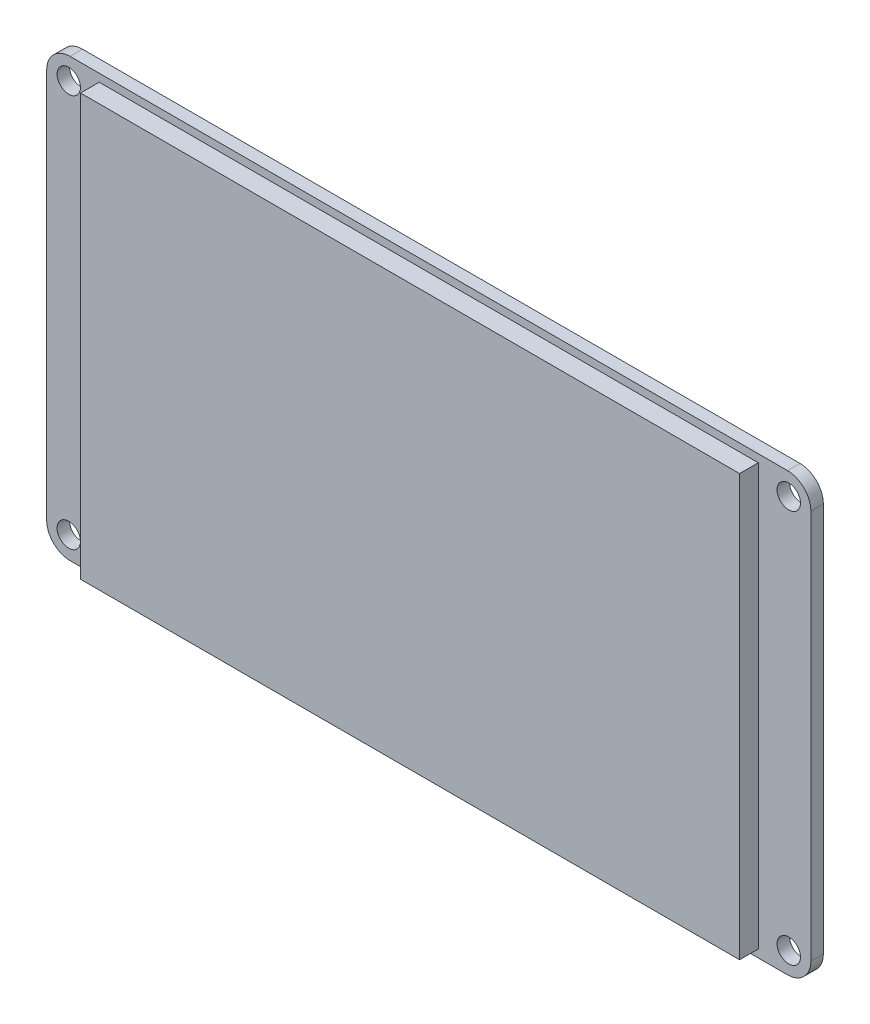
ISO-10303-21;
HEADER;
FILE_DESCRIPTION(('STEP AP214'),'2;1');
FILE_NAME('part.step','',(''),(''),'','','');
FILE_SCHEMA(('AUTOMOTIVE_DESIGN { 1 0 10303 214 1 1 1 1 }'));
ENDSEC;
DATA;
#1=APPLICATION_CONTEXT('core data for automotive mechanical design processes');
#2=APPLICATION_PROTOCOL_DEFINITION('international standard','automotive_design',2000,#1);
#3=PRODUCT_CONTEXT('',#1,'mechanical');
#4=PRODUCT('Part','Part','',(#3));
#5=PRODUCT_RELATED_PRODUCT_CATEGORY('part','',(#4));
#6=PRODUCT_DEFINITION_FORMATION('','',#4);
#7=PRODUCT_DEFINITION_CONTEXT('part definition',#1,'design');
#8=PRODUCT_DEFINITION('design','',#6,#7);
#9=PRODUCT_DEFINITION_SHAPE('','',#8);
#10=(LENGTH_UNIT() NAMED_UNIT(*) SI_UNIT(.MILLI.,.METRE.));
#11=(NAMED_UNIT(*) PLANE_ANGLE_UNIT() SI_UNIT($,.RADIAN.));
#12=(NAMED_UNIT(*) SI_UNIT($,.STERADIAN.) SOLID_ANGLE_UNIT());
#13=UNCERTAINTY_MEASURE_WITH_UNIT(LENGTH_MEASURE(1.E-05),#10,'distance_accuracy_value','');
#14=(GEOMETRIC_REPRESENTATION_CONTEXT(3) GLOBAL_UNCERTAINTY_ASSIGNED_CONTEXT((#13)) GLOBAL_UNIT_ASSIGNED_CONTEXT((#10,
#11,#12)) REPRESENTATION_CONTEXT('',''));
#15=CARTESIAN_POINT('',(0.,0.,0.));
#16=DIRECTION('',(0.,0.,1.));
#17=DIRECTION('',(1.,0.,0.));
#18=AXIS2_PLACEMENT_3D('',#15,#16,#17);
#19=CARTESIAN_POINT('',(0.,28.,1.6));
#20=DIRECTION('',(0.,1.,0.));
#21=DIRECTION('',(-1.,0.,0.));
#22=AXIS2_PLACEMENT_3D('',#19,#20,#21);
#23=PLANE('',#22);
#24=DIRECTION('',(1.,0.,0.));
#25=VECTOR('',#24,1.);
#26=CARTESIAN_POINT('',(0.,28.,0.));
#27=LINE('',#26,#25);
#28=CARTESIAN_POINT('',(-46.,28.,0.));
#29=VERTEX_POINT('',#28);
#30=CARTESIAN_POINT('',(46.,28.,0.));
#31=VERTEX_POINT('',#30);
#32=EDGE_CURVE('E155',#29,#31,#27,.T.);
#33=ORIENTED_EDGE('',*,*,#32,.F.);
#34=DIRECTION('',(0.,0.,-1.));
#35=VECTOR('',#34,1.);
#36=CARTESIAN_POINT('',(-46.,28.,1.6));
#37=LINE('',#36,#35);
#38=CARTESIAN_POINT('',(-46.,28.,1.6));
#39=VERTEX_POINT('',#38);
#40=EDGE_CURVE('E11',#39,#29,#37,.T.);
#41=ORIENTED_EDGE('',*,*,#40,.F.);
#42=DIRECTION('',(1.,0.,0.));
#43=VECTOR('',#42,1.);
#44=CARTESIAN_POINT('',(0.,28.,1.6));
#45=LINE('',#44,#43);
#46=CARTESIAN_POINT('',(46.,28.,1.6));
#47=VERTEX_POINT('',#46);
#48=EDGE_CURVE('E419',#39,#47,#45,.T.);
#49=ORIENTED_EDGE('',*,*,#48,.T.);
#50=DIRECTION('',(0.,0.,-1.));
#51=VECTOR('',#50,1.);
#52=CARTESIAN_POINT('',(46.,28.,1.6));
#53=LINE('',#52,#51);
#54=EDGE_CURVE('E60',#47,#31,#53,.T.);
#55=ORIENTED_EDGE('',*,*,#54,.T.);
#56=EDGE_LOOP('',(#33,#41,#49,#55));
#57=FACE_BOUND('',#56,.T.);
#58=ADVANCED_FACE('F36',(#57),#23,.T.);
#59=CARTESIAN_POINT('',(-46.,25.,1.6));
#60=DIRECTION('',(0.,0.,-1.));
#61=DIRECTION('',(-1.,0.,0.));
#62=AXIS2_PLACEMENT_3D('',#59,#60,#61);
#63=CYLINDRICAL_SURFACE('',#62,3.);
#64=CARTESIAN_POINT('',(-46.,25.,0.));
#65=DIRECTION('',(0.,0.,1.));
#66=DIRECTION('',(1.,0.,0.));
#67=AXIS2_PLACEMENT_3D('',#64,#65,#66);
#68=CIRCLE('',#67,3.);
#69=CARTESIAN_POINT('',(-49.,25.,0.));
#70=VERTEX_POINT('',#69);
#71=EDGE_CURVE('E157',#29,#70,#68,.T.);
#72=ORIENTED_EDGE('',*,*,#71,.T.);
#73=DIRECTION('',(0.,0.,-1.));
#74=VECTOR('',#73,1.);
#75=CARTESIAN_POINT('',(-49.,25.,1.6));
#76=LINE('',#75,#74);
#77=CARTESIAN_POINT('',(-49.,25.,1.6));
#78=VERTEX_POINT('',#77);
#79=EDGE_CURVE('E44',#78,#70,#76,.T.);
#80=ORIENTED_EDGE('',*,*,#79,.F.);
#81=CARTESIAN_POINT('',(-46.,25.,1.6));
#82=DIRECTION('',(0.,0.,1.));
#83=DIRECTION('',(1.,0.,0.));
#84=AXIS2_PLACEMENT_3D('',#81,#82,#83);
#85=CIRCLE('',#84,3.);
#86=EDGE_CURVE('E421',#39,#78,#85,.T.);
#87=ORIENTED_EDGE('',*,*,#86,.F.);
#88=ORIENTED_EDGE('',*,*,#40,.T.);
#89=EDGE_LOOP('',(#72,#80,#87,#88));
#90=FACE_BOUND('',#89,.T.);
#91=ADVANCED_FACE('F194',(#90),#63,.T.);
#92=CARTESIAN_POINT('',(-49.,0.,1.6));
#93=DIRECTION('',(1.,0.,0.));
#94=DIRECTION('',(0.,1.,0.));
#95=AXIS2_PLACEMENT_3D('',#92,#93,#94);
#96=PLANE('',#95);
#97=DIRECTION('',(0.,-1.,0.));
#98=VECTOR('',#97,1.);
#99=CARTESIAN_POINT('',(-49.,0.,0.));
#100=LINE('',#99,#98);
#101=CARTESIAN_POINT('',(-49.,-25.,0.));
#102=VERTEX_POINT('',#101);
#103=EDGE_CURVE('E160',#70,#102,#100,.T.);
#104=ORIENTED_EDGE('',*,*,#103,.T.);
#105=DIRECTION('',(0.,0.,-1.));
#106=VECTOR('',#105,1.);
#107=CARTESIAN_POINT('',(-49.,-25.,1.6));
#108=LINE('',#107,#106);
#109=CARTESIAN_POINT('',(-49.,-25.,1.6));
#110=VERTEX_POINT('',#109);
#111=EDGE_CURVE('E182',#110,#102,#108,.T.);
#112=ORIENTED_EDGE('',*,*,#111,.F.);
#113=DIRECTION('',(0.,-1.,0.));
#114=VECTOR('',#113,1.);
#115=CARTESIAN_POINT('',(-49.,0.,1.6));
#116=LINE('',#115,#114);
#117=EDGE_CURVE('E190',#78,#110,#116,.T.);
#118=ORIENTED_EDGE('',*,*,#117,.F.);
#119=ORIENTED_EDGE('',*,*,#79,.T.);
#120=EDGE_LOOP('',(#104,#112,#118,#119));
#121=FACE_BOUND('',#120,.T.);
#122=ADVANCED_FACE('F187',(#121),#96,.F.);
#123=CARTESIAN_POINT('',(-46.,-25.,1.6));
#124=DIRECTION('',(0.,0.,-1.));
#125=DIRECTION('',(-1.,0.,0.));
#126=AXIS2_PLACEMENT_3D('',#123,#124,#125);
#127=CYLINDRICAL_SURFACE('',#126,3.);
#128=CARTESIAN_POINT('',(-46.,-25.,0.));
#129=DIRECTION('',(0.,0.,1.));
#130=DIRECTION('',(1.,0.,0.));
#131=AXIS2_PLACEMENT_3D('',#128,#129,#130);
#132=CIRCLE('',#131,3.);
#133=CARTESIAN_POINT('',(-46.,-28.,0.));
#134=VERTEX_POINT('',#133);
#135=EDGE_CURVE('E163',#102,#134,#132,.T.);
#136=ORIENTED_EDGE('',*,*,#135,.T.);
#137=DIRECTION('',(0.,0.,-1.));
#138=VECTOR('',#137,1.);
#139=CARTESIAN_POINT('',(-46.,-28.,1.6));
#140=LINE('',#139,#138);
#141=CARTESIAN_POINT('',(-46.,-28.,1.6));
#142=VERTEX_POINT('',#141);
#143=EDGE_CURVE('E179',#142,#134,#140,.T.);
#144=ORIENTED_EDGE('',*,*,#143,.F.);
#145=CARTESIAN_POINT('',(-46.,-25.,1.6));
#146=DIRECTION('',(0.,0.,1.));
#147=DIRECTION('',(1.,0.,0.));
#148=AXIS2_PLACEMENT_3D('',#145,#146,#147);
#149=CIRCLE('',#148,3.);
#150=EDGE_CURVE('E424',#110,#142,#149,.T.);
#151=ORIENTED_EDGE('',*,*,#150,.F.);
#152=ORIENTED_EDGE('',*,*,#111,.T.);
#153=EDGE_LOOP('',(#136,#144,#151,#152));
#154=FACE_BOUND('',#153,.T.);
#155=ADVANCED_FACE('F256',(#154),#127,.T.);
#156=CARTESIAN_POINT('',(0.,-28.,1.6));
#157=DIRECTION('',(0.,1.,0.));
#158=DIRECTION('',(0.,0.,1.));
#159=AXIS2_PLACEMENT_3D('',#156,#157,#158);
#160=PLANE('',#159);
#161=DIRECTION('',(1.,0.,0.));
#162=VECTOR('',#161,1.);
#163=CARTESIAN_POINT('',(0.,-28.,0.));
#164=LINE('',#163,#162);
#165=CARTESIAN_POINT('',(46.,-28.,0.));
#166=VERTEX_POINT('',#165);
#167=EDGE_CURVE('E166',#134,#166,#164,.T.);
#168=ORIENTED_EDGE('',*,*,#167,.T.);
#169=DIRECTION('',(0.,0.,-1.));
#170=VECTOR('',#169,1.);
#171=CARTESIAN_POINT('',(46.,-28.,1.6));
#172=LINE('',#171,#170);
#173=CARTESIAN_POINT('',(46.,-28.,1.6));
#174=VERTEX_POINT('',#173);
#175=EDGE_CURVE('E133',#174,#166,#172,.T.);
#176=ORIENTED_EDGE('',*,*,#175,.F.);
#177=DIRECTION('',(1.,0.,0.));
#178=VECTOR('',#177,1.);
#179=CARTESIAN_POINT('',(0.,-28.,1.6));
#180=LINE('',#179,#178);
#181=EDGE_CURVE('E121',#142,#174,#180,.T.);
#182=ORIENTED_EDGE('',*,*,#181,.F.);
#183=ORIENTED_EDGE('',*,*,#143,.T.);
#184=EDGE_LOOP('',(#168,#176,#182,#183));
#185=FACE_BOUND('',#184,.T.);
#186=ADVANCED_FACE('F253',(#185),#160,.F.);
#187=CARTESIAN_POINT('',(46.,-25.,1.6));
#188=DIRECTION('',(0.,0.,-1.));
#189=DIRECTION('',(-1.,0.,0.));
#190=AXIS2_PLACEMENT_3D('',#187,#188,#189);
#191=CYLINDRICAL_SURFACE('',#190,3.);
#192=CARTESIAN_POINT('',(46.,-25.,0.));
#193=DIRECTION('',(0.,0.,1.));
#194=DIRECTION('',(1.,0.,0.));
#195=AXIS2_PLACEMENT_3D('',#192,#193,#194);
#196=CIRCLE('',#195,3.);
#197=CARTESIAN_POINT('',(49.,-25.,0.));
#198=VERTEX_POINT('',#197);
#199=EDGE_CURVE('E129',#166,#198,#196,.T.);
#200=ORIENTED_EDGE('',*,*,#199,.T.);
#201=DIRECTION('',(0.,0.,-1.));
#202=VECTOR('',#201,1.);
#203=CARTESIAN_POINT('',(49.,-25.,1.6));
#204=LINE('',#203,#202);
#205=CARTESIAN_POINT('',(49.,-25.,1.6));
#206=VERTEX_POINT('',#205);
#207=EDGE_CURVE('E127',#206,#198,#204,.T.);
#208=ORIENTED_EDGE('',*,*,#207,.F.);
#209=CARTESIAN_POINT('',(46.,-25.,1.6));
#210=DIRECTION('',(0.,0.,1.));
#211=DIRECTION('',(1.,0.,0.));
#212=AXIS2_PLACEMENT_3D('',#209,#210,#211);
#213=CIRCLE('',#212,3.);
#214=EDGE_CURVE('E113',#174,#206,#213,.T.);
#215=ORIENTED_EDGE('',*,*,#214,.F.);
#216=ORIENTED_EDGE('',*,*,#175,.T.);
#217=EDGE_LOOP('',(#200,#208,#215,#216));
#218=FACE_BOUND('',#217,.T.);
#219=ADVANCED_FACE('F128',(#218),#191,.T.);
#220=CARTESIAN_POINT('',(49.,0.,1.6));
#221=DIRECTION('',(1.,0.,0.));
#222=DIRECTION('',(0.,0.,-1.));
#223=AXIS2_PLACEMENT_3D('',#220,#221,#222);
#224=PLANE('',#223);
#225=DIRECTION('',(0.,-1.,0.));
#226=VECTOR('',#225,1.);
#227=CARTESIAN_POINT('',(49.,0.,0.));
#228=LINE('',#227,#226);
#229=CARTESIAN_POINT('',(49.,25.,0.));
#230=VERTEX_POINT('',#229);
#231=EDGE_CURVE('E170',#230,#198,#228,.T.);
#232=ORIENTED_EDGE('',*,*,#231,.F.);
#233=DIRECTION('',(0.,0.,-1.));
#234=VECTOR('',#233,1.);
#235=CARTESIAN_POINT('',(49.,25.,1.6));
#236=LINE('',#235,#234);
#237=CARTESIAN_POINT('',(49.,25.,1.6));
#238=VERTEX_POINT('',#237);
#239=EDGE_CURVE('E134',#238,#230,#236,.T.);
#240=ORIENTED_EDGE('',*,*,#239,.F.);
#241=DIRECTION('',(0.,-1.,0.));
#242=VECTOR('',#241,1.);
#243=CARTESIAN_POINT('',(49.,0.,1.6));
#244=LINE('',#243,#242);
#245=EDGE_CURVE('E119',#238,#206,#244,.T.);
#246=ORIENTED_EDGE('',*,*,#245,.T.);
#247=ORIENTED_EDGE('',*,*,#207,.T.);
#248=EDGE_LOOP('',(#232,#240,#246,#247));
#249=FACE_BOUND('',#248,.T.);
#250=ADVANCED_FACE('F136',(#249),#224,.T.);
#251=CARTESIAN_POINT('',(46.165,-25.21,1.6));
#252=DIRECTION('',(0.,0.,-1.));
#253=DIRECTION('',(-1.,0.,0.));
#254=AXIS2_PLACEMENT_3D('',#251,#252,#253);
#255=CYLINDRICAL_SURFACE('',#254,1.5);
#256=CARTESIAN_POINT('',(46.165,-25.21,1.6));
#257=DIRECTION('',(0.,0.,1.));
#258=DIRECTION('',(1.,0.,0.));
#259=AXIS2_PLACEMENT_3D('',#256,#257,#258);
#260=CIRCLE('',#259,1.5);
#261=CARTESIAN_POINT('',(47.665,-25.21,1.6));
#262=VERTEX_POINT('',#261);
#263=EDGE_CURVE('E416',#262,#262,#260,.T.);
#264=ORIENTED_EDGE('',*,*,#263,.T.);
#265=EDGE_LOOP('',(#264));
#266=FACE_BOUND('',#265,.T.);
#267=CARTESIAN_POINT('',(46.165,-25.21,0.));
#268=DIRECTION('',(0.,0.,1.));
#269=DIRECTION('',(1.,0.,0.));
#270=AXIS2_PLACEMENT_3D('',#267,#268,#269);
#271=CIRCLE('',#270,1.5);
#272=CARTESIAN_POINT('',(47.665,-25.21,0.));
#273=VERTEX_POINT('',#272);
#274=EDGE_CURVE('E152',#273,#273,#271,.T.);
#275=ORIENTED_EDGE('',*,*,#274,.F.);
#276=EDGE_LOOP('',(#275));
#277=FACE_BOUND('',#276,.T.);
#278=ADVANCED_FACE('F205',(#266,#277),#255,.F.);
#279=CARTESIAN_POINT('',(46.165,25.21,1.6));
#280=DIRECTION('',(0.,0.,-1.));
#281=DIRECTION('',(-1.,0.,0.));
#282=AXIS2_PLACEMENT_3D('',#279,#280,#281);
#283=CYLINDRICAL_SURFACE('',#282,1.5);
#284=CARTESIAN_POINT('',(46.165,25.21,1.6));
#285=DIRECTION('',(0.,0.,1.));
#286=DIRECTION('',(1.,0.,0.));
#287=AXIS2_PLACEMENT_3D('',#284,#285,#286);
#288=CIRCLE('',#287,1.5);
#289=CARTESIAN_POINT('',(47.665,25.21,1.6));
#290=VERTEX_POINT('',#289);
#291=EDGE_CURVE('E413',#290,#290,#288,.F.);
#292=ORIENTED_EDGE('',*,*,#291,.F.);
#293=EDGE_LOOP('',(#292));
#294=FACE_BOUND('',#293,.T.);
#295=CARTESIAN_POINT('',(46.165,25.21,0.));
#296=DIRECTION('',(0.,0.,1.));
#297=DIRECTION('',(1.,0.,0.));
#298=AXIS2_PLACEMENT_3D('',#295,#296,#297);
#299=CIRCLE('',#298,1.5);
#300=CARTESIAN_POINT('',(47.665,25.21,0.));
#301=VERTEX_POINT('',#300);
#302=EDGE_CURVE('E149',#301,#301,#299,.F.);
#303=ORIENTED_EDGE('',*,*,#302,.T.);
#304=EDGE_LOOP('',(#303));
#305=FACE_BOUND('',#304,.T.);
#306=ADVANCED_FACE('F208',(#294,#305),#283,.F.);
#307=CARTESIAN_POINT('',(-46.165,25.21,1.6));
#308=DIRECTION('',(0.,0.,-1.));
#309=DIRECTION('',(-1.,0.,0.));
#310=AXIS2_PLACEMENT_3D('',#307,#308,#309);
#311=CYLINDRICAL_SURFACE('',#310,1.5);
#312=CARTESIAN_POINT('',(-46.165,25.21,1.6));
#313=DIRECTION('',(0.,0.,1.));
#314=DIRECTION('',(1.,0.,0.));
#315=AXIS2_PLACEMENT_3D('',#312,#313,#314);
#316=CIRCLE('',#315,1.5);
#317=CARTESIAN_POINT('',(-44.665,25.21,1.6));
#318=VERTEX_POINT('',#317);
#319=EDGE_CURVE('E223',#318,#318,#316,.T.);
#320=ORIENTED_EDGE('',*,*,#319,.T.);
#321=EDGE_LOOP('',(#320));
#322=FACE_BOUND('',#321,.T.);
#323=CARTESIAN_POINT('',(-46.165,25.21,0.));
#324=DIRECTION('',(0.,0.,1.));
#325=DIRECTION('',(1.,0.,0.));
#326=AXIS2_PLACEMENT_3D('',#323,#324,#325);
#327=CIRCLE('',#326,1.5);
#328=CARTESIAN_POINT('',(-44.665,25.21,0.));
#329=VERTEX_POINT('',#328);
#330=EDGE_CURVE('E145',#329,#329,#327,.T.);
#331=ORIENTED_EDGE('',*,*,#330,.F.);
#332=EDGE_LOOP('',(#331));
#333=FACE_BOUND('',#332,.T.);
#334=ADVANCED_FACE('F211',(#322,#333),#311,.F.);
#335=CARTESIAN_POINT('',(-46.165,-25.21,1.6));
#336=DIRECTION('',(0.,0.,-1.));
#337=DIRECTION('',(-1.,0.,0.));
#338=AXIS2_PLACEMENT_3D('',#335,#336,#337);
#339=CYLINDRICAL_SURFACE('',#338,1.5);
#340=CARTESIAN_POINT('',(-46.165,-25.21,1.6));
#341=DIRECTION('',(0.,0.,1.));
#342=DIRECTION('',(1.,0.,0.));
#343=AXIS2_PLACEMENT_3D('',#340,#341,#342);
#344=CIRCLE('',#343,1.5);
#345=CARTESIAN_POINT('',(-44.665,-25.21,1.6));
#346=VERTEX_POINT('',#345);
#347=EDGE_CURVE('E175',#346,#346,#344,.F.);
#348=ORIENTED_EDGE('',*,*,#347,.F.);
#349=EDGE_LOOP('',(#348));
#350=FACE_BOUND('',#349,.T.);
#351=CARTESIAN_POINT('',(-46.165,-25.21,0.));
#352=DIRECTION('',(0.,0.,1.));
#353=DIRECTION('',(1.,0.,0.));
#354=AXIS2_PLACEMENT_3D('',#351,#352,#353);
#355=CIRCLE('',#354,1.5);
#356=CARTESIAN_POINT('',(-44.665,-25.21,0.));
#357=VERTEX_POINT('',#356);
#358=EDGE_CURVE('E142',#357,#357,#355,.F.);
#359=ORIENTED_EDGE('',*,*,#358,.T.);
#360=EDGE_LOOP('',(#359));
#361=FACE_BOUND('',#360,.T.);
#362=ADVANCED_FACE('F38',(#350,#361),#339,.F.);
#363=CARTESIAN_POINT('',(46.,25.,1.6));
#364=DIRECTION('',(0.,0.,-1.));
#365=DIRECTION('',(-1.,0.,0.));
#366=AXIS2_PLACEMENT_3D('',#363,#364,#365);
#367=CYLINDRICAL_SURFACE('',#366,3.);
#368=CARTESIAN_POINT('',(46.,25.,0.));
#369=DIRECTION('',(0.,0.,1.));
#370=DIRECTION('',(1.,0.,0.));
#371=AXIS2_PLACEMENT_3D('',#368,#369,#370);
#372=CIRCLE('',#371,3.);
#373=EDGE_CURVE('E172',#31,#230,#372,.F.);
#374=ORIENTED_EDGE('',*,*,#373,.F.);
#375=ORIENTED_EDGE('',*,*,#54,.F.);
#376=CARTESIAN_POINT('',(46.,25.,1.6));
#377=DIRECTION('',(0.,0.,1.));
#378=DIRECTION('',(1.,0.,0.));
#379=AXIS2_PLACEMENT_3D('',#376,#377,#378);
#380=CIRCLE('',#379,3.);
#381=EDGE_CURVE('E137',#47,#238,#380,.F.);
#382=ORIENTED_EDGE('',*,*,#381,.T.);
#383=ORIENTED_EDGE('',*,*,#239,.T.);
#384=EDGE_LOOP('',(#374,#375,#382,#383));
#385=FACE_BOUND('',#384,.T.);
#386=ADVANCED_FACE('F218',(#385),#367,.T.);
#387=CARTESIAN_POINT('',(0.,0.,1.6));
#388=DIRECTION('',(0.,0.,1.));
#389=DIRECTION('',(1.,0.,0.));
#390=AXIS2_PLACEMENT_3D('',#387,#388,#389);
#391=PLANE('',#390);
#392=DIRECTION('',(0.,1.,0.));
#393=VECTOR('',#392,1.);
#394=CARTESIAN_POINT('',(42.26,0.,1.6));
#395=LINE('',#394,#393);
#396=CARTESIAN_POINT('',(42.26,-27.,1.6));
#397=VERTEX_POINT('',#396);
#398=CARTESIAN_POINT('',(42.26,27.,1.6));
#399=VERTEX_POINT('',#398);
#400=EDGE_CURVE('E146',#397,#399,#395,.T.);
#401=ORIENTED_EDGE('',*,*,#400,.F.);
#402=DIRECTION('',(-1.,0.,0.));
#403=VECTOR('',#402,1.);
#404=CARTESIAN_POINT('',(0.,-27.,1.6));
#405=LINE('',#404,#403);
#406=CARTESIAN_POINT('',(-42.26,-27.,1.6));
#407=VERTEX_POINT('',#406);
#408=EDGE_CURVE('E400',#397,#407,#405,.T.);
#409=ORIENTED_EDGE('',*,*,#408,.T.);
#410=DIRECTION('',(0.,1.,0.));
#411=VECTOR('',#410,1.);
#412=CARTESIAN_POINT('',(-42.26,0.,1.6));
#413=LINE('',#412,#411);
#414=CARTESIAN_POINT('',(-42.26,27.,1.6));
#415=VERTEX_POINT('',#414);
#416=EDGE_CURVE('E403',#407,#415,#413,.T.);
#417=ORIENTED_EDGE('',*,*,#416,.T.);
#418=DIRECTION('',(-1.,0.,0.));
#419=VECTOR('',#418,1.);
#420=CARTESIAN_POINT('',(0.,27.,1.6));
#421=LINE('',#420,#419);
#422=EDGE_CURVE('E406',#399,#415,#421,.T.);
#423=ORIENTED_EDGE('',*,*,#422,.F.);
#424=EDGE_LOOP('',(#401,#409,#417,#423));
#425=FACE_BOUND('',#424,.T.);
#426=ORIENTED_EDGE('',*,*,#347,.T.);
#427=EDGE_LOOP('',(#426));
#428=FACE_BOUND('',#427,.T.);
#429=ORIENTED_EDGE('',*,*,#319,.F.);
#430=EDGE_LOOP('',(#429));
#431=FACE_BOUND('',#430,.T.);
#432=ORIENTED_EDGE('',*,*,#291,.T.);
#433=EDGE_LOOP('',(#432));
#434=FACE_BOUND('',#433,.T.);
#435=ORIENTED_EDGE('',*,*,#263,.F.);
#436=EDGE_LOOP('',(#435));
#437=FACE_BOUND('',#436,.T.);
#438=ORIENTED_EDGE('',*,*,#48,.F.);
#439=ORIENTED_EDGE('',*,*,#86,.T.);
#440=ORIENTED_EDGE('',*,*,#117,.T.);
#441=ORIENTED_EDGE('',*,*,#150,.T.);
#442=ORIENTED_EDGE('',*,*,#181,.T.);
#443=ORIENTED_EDGE('',*,*,#214,.T.);
#444=ORIENTED_EDGE('',*,*,#245,.F.);
#445=ORIENTED_EDGE('',*,*,#381,.F.);
#446=EDGE_LOOP('',(#438,#439,#440,#441,#442,#443,#444,#445));
#447=FACE_BOUND('',#446,.T.);
#448=ADVANCED_FACE('F116',(#425,#428,#431,#434,#437,#447),#391,.T.);
#449=CARTESIAN_POINT('',(0.,0.,0.));
#450=DIRECTION('',(0.,0.,1.));
#451=DIRECTION('',(1.,0.,0.));
#452=AXIS2_PLACEMENT_3D('',#449,#450,#451);
#453=PLANE('',#452);
#454=ORIENTED_EDGE('',*,*,#358,.F.);
#455=EDGE_LOOP('',(#454));
#456=FACE_BOUND('',#455,.T.);
#457=ORIENTED_EDGE('',*,*,#330,.T.);
#458=EDGE_LOOP('',(#457));
#459=FACE_BOUND('',#458,.T.);
#460=ORIENTED_EDGE('',*,*,#302,.F.);
#461=EDGE_LOOP('',(#460));
#462=FACE_BOUND('',#461,.T.);
#463=ORIENTED_EDGE('',*,*,#274,.T.);
#464=EDGE_LOOP('',(#463));
#465=FACE_BOUND('',#464,.T.);
#466=ORIENTED_EDGE('',*,*,#32,.T.);
#467=ORIENTED_EDGE('',*,*,#373,.T.);
#468=ORIENTED_EDGE('',*,*,#231,.T.);
#469=ORIENTED_EDGE('',*,*,#199,.F.);
#470=ORIENTED_EDGE('',*,*,#167,.F.);
#471=ORIENTED_EDGE('',*,*,#135,.F.);
#472=ORIENTED_EDGE('',*,*,#103,.F.);
#473=ORIENTED_EDGE('',*,*,#71,.F.);
#474=EDGE_LOOP('',(#466,#467,#468,#469,#470,#471,#472,#473));
#475=FACE_BOUND('',#474,.T.);
#476=ADVANCED_FACE('F196',(#456,#459,#462,#465,#475),#453,.F.);
#477=CARTESIAN_POINT('',(42.26,0.,4.));
#478=DIRECTION('',(1.,0.,0.));
#479=DIRECTION('',(0.,0.,-1.));
#480=AXIS2_PLACEMENT_3D('',#477,#478,#479);
#481=PLANE('',#480);
#482=DIRECTION('',(0.,0.,-1.));
#483=VECTOR('',#482,1.);
#484=CARTESIAN_POINT('',(42.26,-27.,4.));
#485=LINE('',#484,#483);
#486=CARTESIAN_POINT('',(42.26,-27.,4.));
#487=VERTEX_POINT('',#486);
#488=EDGE_CURVE('E395',#487,#397,#485,.T.);
#489=ORIENTED_EDGE('',*,*,#488,.T.);
#490=ORIENTED_EDGE('',*,*,#400,.T.);
#491=DIRECTION('',(0.,0.,-1.));
#492=VECTOR('',#491,1.);
#493=CARTESIAN_POINT('',(42.26,27.,4.));
#494=LINE('',#493,#492);
#495=CARTESIAN_POINT('',(42.26,27.,4.));
#496=VERTEX_POINT('',#495);
#497=EDGE_CURVE('E385',#496,#399,#494,.T.);
#498=ORIENTED_EDGE('',*,*,#497,.F.);
#499=DIRECTION('',(0.,-1.,0.));
#500=VECTOR('',#499,1.);
#501=CARTESIAN_POINT('',(42.26,0.,4.));
#502=LINE('',#501,#500);
#503=EDGE_CURVE('E370',#496,#487,#502,.T.);
#504=ORIENTED_EDGE('',*,*,#503,.T.);
#505=EDGE_LOOP('',(#489,#490,#498,#504));
#506=FACE_BOUND('',#505,.T.);
#507=ADVANCED_FACE('F228',(#506),#481,.T.);
#508=CARTESIAN_POINT('',(0.,27.,4.));
#509=DIRECTION('',(0.,1.,0.));
#510=DIRECTION('',(0.,0.,1.));
#511=AXIS2_PLACEMENT_3D('',#508,#509,#510);
#512=PLANE('',#511);
#513=ORIENTED_EDGE('',*,*,#497,.T.);
#514=ORIENTED_EDGE('',*,*,#422,.T.);
#515=DIRECTION('',(0.,0.,-1.));
#516=VECTOR('',#515,1.);
#517=CARTESIAN_POINT('',(-42.26,27.,4.));
#518=LINE('',#517,#516);
#519=CARTESIAN_POINT('',(-42.26,27.,4.));
#520=VERTEX_POINT('',#519);
#521=EDGE_CURVE('E388',#520,#415,#518,.T.);
#522=ORIENTED_EDGE('',*,*,#521,.F.);
#523=DIRECTION('',(1.,0.,0.));
#524=VECTOR('',#523,1.);
#525=CARTESIAN_POINT('',(0.,27.,4.));
#526=LINE('',#525,#524);
#527=EDGE_CURVE('E374',#520,#496,#526,.T.);
#528=ORIENTED_EDGE('',*,*,#527,.T.);
#529=EDGE_LOOP('',(#513,#514,#522,#528));
#530=FACE_BOUND('',#529,.T.);
#531=ADVANCED_FACE('F240',(#530),#512,.T.);
#532=CARTESIAN_POINT('',(-42.26,0.,4.));
#533=DIRECTION('',(1.,0.,0.));
#534=DIRECTION('',(0.,0.,-1.));
#535=AXIS2_PLACEMENT_3D('',#532,#533,#534);
#536=PLANE('',#535);
#537=ORIENTED_EDGE('',*,*,#416,.F.);
#538=DIRECTION('',(0.,0.,-1.));
#539=VECTOR('',#538,1.);
#540=CARTESIAN_POINT('',(-42.26,-27.,4.));
#541=LINE('',#540,#539);
#542=CARTESIAN_POINT('',(-42.26,-27.,4.));
#543=VERTEX_POINT('',#542);
#544=EDGE_CURVE('E51',#543,#407,#541,.T.);
#545=ORIENTED_EDGE('',*,*,#544,.F.);
#546=DIRECTION('',(0.,-1.,0.));
#547=VECTOR('',#546,1.);
#548=CARTESIAN_POINT('',(-42.26,0.,4.));
#549=LINE('',#548,#547);
#550=EDGE_CURVE('E390',#520,#543,#549,.T.);
#551=ORIENTED_EDGE('',*,*,#550,.F.);
#552=ORIENTED_EDGE('',*,*,#521,.T.);
#553=EDGE_LOOP('',(#537,#545,#551,#552));
#554=FACE_BOUND('',#553,.T.);
#555=ADVANCED_FACE('F330',(#554),#536,.F.);
#556=CARTESIAN_POINT('',(0.,-27.,4.));
#557=DIRECTION('',(0.,1.,0.));
#558=DIRECTION('',(0.,0.,1.));
#559=AXIS2_PLACEMENT_3D('',#556,#557,#558);
#560=PLANE('',#559);
#561=ORIENTED_EDGE('',*,*,#408,.F.);
#562=ORIENTED_EDGE('',*,*,#488,.F.);
#563=DIRECTION('',(1.,0.,0.));
#564=VECTOR('',#563,1.);
#565=CARTESIAN_POINT('',(0.,-27.,4.));
#566=LINE('',#565,#564);
#567=EDGE_CURVE('E376',#543,#487,#566,.T.);
#568=ORIENTED_EDGE('',*,*,#567,.F.);
#569=ORIENTED_EDGE('',*,*,#544,.T.);
#570=EDGE_LOOP('',(#561,#562,#568,#569));
#571=FACE_BOUND('',#570,.T.);
#572=ADVANCED_FACE('F340',(#571),#560,.F.);
#573=CARTESIAN_POINT('',(0.,0.,4.));
#574=DIRECTION('',(0.,0.,1.));
#575=DIRECTION('',(1.,0.,0.));
#576=AXIS2_PLACEMENT_3D('',#573,#574,#575);
#577=PLANE('',#576);
#578=ORIENTED_EDGE('',*,*,#503,.F.);
#579=ORIENTED_EDGE('',*,*,#527,.F.);
#580=ORIENTED_EDGE('',*,*,#550,.T.);
#581=ORIENTED_EDGE('',*,*,#567,.T.);
#582=EDGE_LOOP('',(#578,#579,#580,#581));
#583=FACE_BOUND('',#582,.T.);
#584=ADVANCED_FACE('F350',(#583),#577,.T.);
#585=CLOSED_SHELL('',(#58,#91,#122,#155,#186,#219,#250,#278,#306,#334,#362,#386,#448,#476,#507,
#531,#555,#572,#584));
#586=MANIFOLD_SOLID_BREP('B2',#585);
#587=ADVANCED_BREP_SHAPE_REPRESENTATION('',(#18,#586),#14);
#588=SHAPE_DEFINITION_REPRESENTATION(#9,#587);
ENDSEC;
END-ISO-10303-21;
